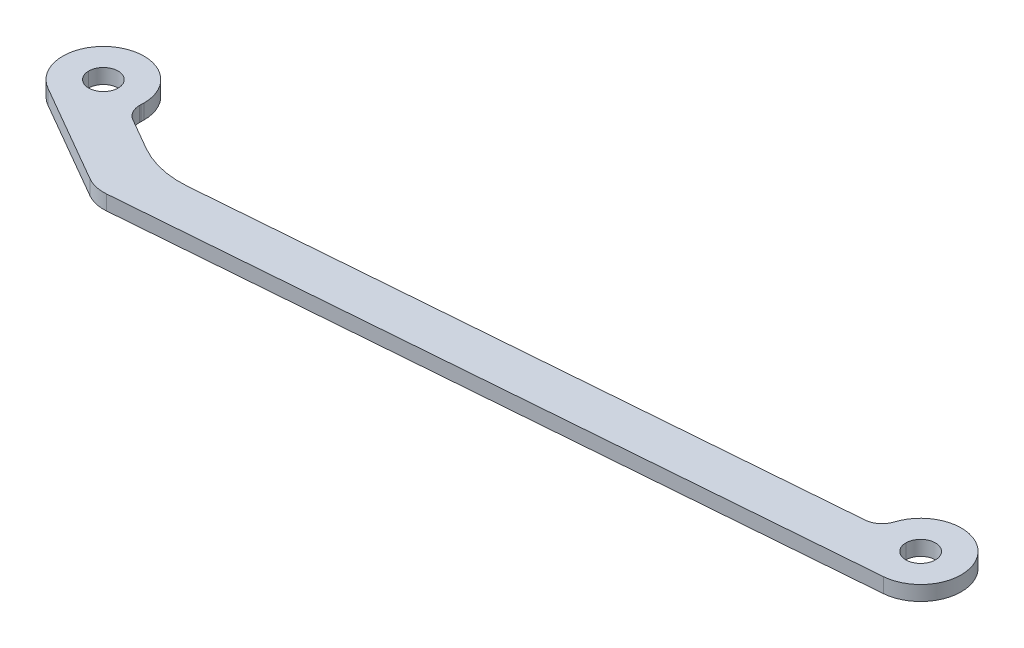
ISO-10303-21;
HEADER;
FILE_DESCRIPTION(('STEP AP214'),'2;1');
FILE_NAME('part.step','',(''),(''),'','','');
FILE_SCHEMA(('AUTOMOTIVE_DESIGN { 1 0 10303 214 1 1 1 1 }'));
ENDSEC;
DATA;
#1=APPLICATION_CONTEXT('core data for automotive mechanical design processes');
#2=APPLICATION_PROTOCOL_DEFINITION('international standard','automotive_design',2000,#1);
#3=PRODUCT_CONTEXT('',#1,'mechanical');
#4=PRODUCT('Part','Part','',(#3));
#5=PRODUCT_RELATED_PRODUCT_CATEGORY('part','',(#4));
#6=PRODUCT_DEFINITION_FORMATION('','',#4);
#7=PRODUCT_DEFINITION_CONTEXT('part definition',#1,'design');
#8=PRODUCT_DEFINITION('design','',#6,#7);
#9=PRODUCT_DEFINITION_SHAPE('','',#8);
#10=(LENGTH_UNIT() NAMED_UNIT(*) SI_UNIT(.MILLI.,.METRE.));
#11=(NAMED_UNIT(*) PLANE_ANGLE_UNIT() SI_UNIT($,.RADIAN.));
#12=(NAMED_UNIT(*) SI_UNIT($,.STERADIAN.) SOLID_ANGLE_UNIT());
#13=UNCERTAINTY_MEASURE_WITH_UNIT(LENGTH_MEASURE(1.E-05),#10,'distance_accuracy_value','');
#14=(GEOMETRIC_REPRESENTATION_CONTEXT(3) GLOBAL_UNCERTAINTY_ASSIGNED_CONTEXT((#13)) GLOBAL_UNIT_ASSIGNED_CONTEXT((#10,
#11,#12)) REPRESENTATION_CONTEXT('',''));
#15=CARTESIAN_POINT('',(0.,0.,0.));
#16=DIRECTION('',(0.,0.,1.));
#17=DIRECTION('',(1.,0.,0.));
#18=AXIS2_PLACEMENT_3D('',#15,#16,#17);
#19=CARTESIAN_POINT('',(0.,-9.72116766041997,-5.72116766042007));
#20=DIRECTION('',(0.,1.,0.));
#21=DIRECTION('',(0.,0.,-1.));
#22=AXIS2_PLACEMENT_3D('',#19,#20,#21);
#23=PLANE('',#22);
#24=CARTESIAN_POINT('',(221.4,-9.72116766041997,-5.72116766042007));
#25=DIRECTION('',(0.,1.,0.));
#26=DIRECTION('',(1.,0.,0.));
#27=AXIS2_PLACEMENT_3D('',#24,#25,#26);
#28=CIRCLE('',#27,4.);
#29=CARTESIAN_POINT('',(217.4,-9.72116766041997,-5.72116766042005));
#30=VERTEX_POINT('',#29);
#31=CARTESIAN_POINT('',(225.4,-9.72116766041997,-5.72116766042005));
#32=VERTEX_POINT('',#31);
#33=EDGE_CURVE('E346',#30,#32,#28,.T.);
#34=ORIENTED_EDGE('',*,*,#33,.T.);
#35=CARTESIAN_POINT('',(221.4,-9.72116766041997,-5.72116766042007));
#36=DIRECTION('',(0.,1.,0.));
#37=DIRECTION('',(1.,0.,0.));
#38=AXIS2_PLACEMENT_3D('',#35,#36,#37);
#39=CIRCLE('',#38,4.);
#40=EDGE_CURVE('E11',#32,#30,#39,.T.);
#41=ORIENTED_EDGE('',*,*,#40,.T.);
#42=EDGE_LOOP('',(#34,#41));
#43=FACE_BOUND('',#42,.T.);
#44=CARTESIAN_POINT('',(0.,-9.72116766041997,-5.72116766042007));
#45=DIRECTION('',(0.,1.,0.));
#46=DIRECTION('',(1.,0.,0.));
#47=AXIS2_PLACEMENT_3D('',#44,#45,#46);
#48=CIRCLE('',#47,4.);
#49=CARTESIAN_POINT('',(-4.,-9.72116766041997,-5.72116766042005));
#50=VERTEX_POINT('',#49);
#51=CARTESIAN_POINT('',(4.,-9.72116766041997,-5.72116766042005));
#52=VERTEX_POINT('',#51);
#53=EDGE_CURVE('E300',#50,#52,#48,.T.);
#54=ORIENTED_EDGE('',*,*,#53,.T.);
#55=CARTESIAN_POINT('',(0.,-9.72116766041997,-5.72116766042007));
#56=DIRECTION('',(0.,1.,0.));
#57=DIRECTION('',(1.,0.,0.));
#58=AXIS2_PLACEMENT_3D('',#55,#56,#57);
#59=CIRCLE('',#58,4.);
#60=EDGE_CURVE('E139',#52,#50,#59,.T.);
#61=ORIENTED_EDGE('',*,*,#60,.T.);
#62=EDGE_LOOP('',(#54,#61));
#63=FACE_BOUND('',#62,.T.);
#64=CARTESIAN_POINT('',(0.,-9.72116766041997,-5.72116766042007));
#65=DIRECTION('',(0.,1.,0.));
#66=DIRECTION('',(1.,0.,0.));
#67=AXIS2_PLACEMENT_3D('',#64,#65,#66);
#68=CIRCLE('',#67,11.);
#69=CARTESIAN_POINT('',(10.9724558586343,-9.72116766041998,-4.94321365771633));
#70=VERTEX_POINT('',#69);
#71=CARTESIAN_POINT('',(11.,-9.72116766041997,-5.72116766042005));
#72=VERTEX_POINT('',#71);
#73=EDGE_CURVE('E270',#70,#72,#68,.T.);
#74=ORIENTED_EDGE('',*,*,#73,.F.);
#75=CARTESIAN_POINT('',(15.9599357943771,-9.72116766041999,-4.58959820194191));
#76=DIRECTION('',(0.,-1.,0.));
#77=DIRECTION('',(1.,0.,0.));
#78=AXIS2_PLACEMENT_3D('',#75,#76,#77);
#79=CIRCLE('',#78,5.);
#80=CARTESIAN_POINT('',(10.9599357943771,-9.72116766041999,-4.58959820194189));
#81=VERTEX_POINT('',#80);
#82=EDGE_CURVE('E313',#81,#70,#79,.T.);
#83=ORIENTED_EDGE('',*,*,#82,.F.);
#84=CARTESIAN_POINT('',(15.9599357943771,-9.72116766041999,-4.58959820194191));
#85=DIRECTION('',(0.,-1.,0.));
#86=DIRECTION('',(1.,0.,0.));
#87=AXIS2_PLACEMENT_3D('',#84,#85,#86);
#88=CIRCLE('',#87,5.);
#89=CARTESIAN_POINT('',(13.4599357943771,-9.72116766042003,-0.259471183019712));
#90=VERTEX_POINT('',#89);
#91=EDGE_CURVE('E258',#90,#81,#88,.T.);
#92=ORIENTED_EDGE('',*,*,#91,.F.);
#93=DIRECTION('',(-0.866025403784508,0.,-0.499999999999881));
#94=VECTOR('',#93,1.);
#95=CARTESIAN_POINT('',(21.9707185919304,-9.72116766042008,4.65423155616053));
#96=LINE('',#95,#94);
#97=CARTESIAN_POINT('',(21.9707185919304,-9.72116766042008,4.65423155616055));
#98=VERTEX_POINT('',#97);
#99=EDGE_CURVE('E242',#98,#90,#96,.T.);
#100=ORIENTED_EDGE('',*,*,#99,.F.);
#101=CARTESIAN_POINT('',(34.4707185919301,-9.72116766041985,-16.9964035384499));
#102=DIRECTION('',(0.,-1.,0.));
#103=DIRECTION('',(1.,0.,0.));
#104=AXIS2_PLACEMENT_3D('',#101,#102,#103);
#105=CIRCLE('',#104,24.9999999999994);
#106=CARTESIAN_POINT('',(36.4447228614748,-9.72116766042012,7.92554075054603));
#107=VERTEX_POINT('',#106);
#108=EDGE_CURVE('E191',#107,#98,#105,.T.);
#109=ORIENTED_EDGE('',*,*,#108,.F.);
#110=DIRECTION('',(-0.996877771559839,0.,0.0789601707817876));
#111=VECTOR('',#110,1.);
#112=CARTESIAN_POINT('',(206.534952986696,-9.72116766041997,-5.54687683379449));
#113=LINE('',#112,#111);
#114=CARTESIAN_POINT('',(206.534952986696,-9.72116766041997,-5.54687683379449));
#115=VERTEX_POINT('',#114);
#116=EDGE_CURVE('E202',#115,#107,#113,.T.);
#117=ORIENTED_EDGE('',*,*,#116,.F.);
#118=CARTESIAN_POINT('',(206.140152132787,-9.72116766041992,-10.5312656915937));
#119=DIRECTION('',(0.,-1.,0.));
#120=DIRECTION('',(1.,0.,0.));
#121=AXIS2_PLACEMENT_3D('',#118,#119,#120);
#122=CIRCLE('',#121,5.);
#123=CARTESIAN_POINT('',(210.908854591291,-9.72116766041994,-9.02811005685194));
#124=VERTEX_POINT('',#123);
#125=EDGE_CURVE('E206',#124,#115,#122,.T.);
#126=ORIENTED_EDGE('',*,*,#125,.F.);
#127=CARTESIAN_POINT('',(221.4,-9.72116766041997,-5.72116766042007));
#128=DIRECTION('',(0.,1.,0.));
#129=DIRECTION('',(1.,0.,0.));
#130=AXIS2_PLACEMENT_3D('',#127,#128,#129);
#131=CIRCLE('',#130,11.);
#132=CARTESIAN_POINT('',(222.2685618786,-9.72116766042009,5.24448782673815));
#133=VERTEX_POINT('',#132);
#134=EDGE_CURVE('E233',#133,#124,#131,.T.);
#135=ORIENTED_EDGE('',*,*,#134,.F.);
#136=DIRECTION('',(0.996877771559839,0.,-0.0789601707817876));
#137=VECTOR('',#136,1.);
#138=CARTESIAN_POINT('',(27.2685618785997,-9.72116766042025,20.6899453760184));
#139=LINE('',#138,#137);
#140=CARTESIAN_POINT('',(27.2685618785997,-9.72116766042025,20.6899453760184));
#141=VERTEX_POINT('',#140);
#142=EDGE_CURVE('E250',#141,#133,#139,.T.);
#143=ORIENTED_EDGE('',*,*,#142,.F.);
#144=CARTESIAN_POINT('',(26.4789601707818,-9.72116766042014,10.72116766042));
#145=DIRECTION('',(0.,1.,0.));
#146=DIRECTION('',(1.,0.,0.));
#147=AXIS2_PLACEMENT_3D('',#144,#145,#146);
#148=CIRCLE('',#147,10.);
#149=CARTESIAN_POINT('',(21.4789601707818,-9.72116766042024,19.3814216982645));
#150=VERTEX_POINT('',#149);
#151=EDGE_CURVE('E294',#150,#141,#148,.T.);
#152=ORIENTED_EDGE('',*,*,#151,.F.);
#153=DIRECTION('',(0.866025403784454,0.,0.499999999999974));
#154=VECTOR('',#153,1.);
#155=CARTESIAN_POINT('',(-5.49999999999986,-9.72116766042007,3.80511178120851));
#156=LINE('',#155,#154);
#157=CARTESIAN_POINT('',(-5.49999999997703,-9.72116766042007,3.80511178122201));
#158=VERTEX_POINT('',#157);
#159=EDGE_CURVE('E351',#158,#150,#156,.T.);
#160=ORIENTED_EDGE('',*,*,#159,.F.);
#161=CARTESIAN_POINT('',(0.,-9.72116766041997,-5.72116766042007));
#162=DIRECTION('',(0.,1.,0.));
#163=DIRECTION('',(1.,0.,0.));
#164=AXIS2_PLACEMENT_3D('',#161,#162,#163);
#165=CIRCLE('',#164,11.);
#166=CARTESIAN_POINT('',(-11.,-9.72116766041997,-5.72116766042005));
#167=VERTEX_POINT('',#166);
#168=EDGE_CURVE('E308',#167,#158,#165,.T.);
#169=ORIENTED_EDGE('',*,*,#168,.F.);
#170=CARTESIAN_POINT('',(0.,-9.72116766041997,-5.72116766042007));
#171=DIRECTION('',(0.,1.,0.));
#172=DIRECTION('',(1.,0.,0.));
#173=AXIS2_PLACEMENT_3D('',#170,#171,#172);
#174=CIRCLE('',#173,11.);
#175=EDGE_CURVE('E223',#72,#167,#174,.T.);
#176=ORIENTED_EDGE('',*,*,#175,.F.);
#177=EDGE_LOOP('',(#74,#83,#92,#100,#109,#117,#126,#135,#143,#152,#160,#169,#176));
#178=FACE_BOUND('',#177,.T.);
#179=ADVANCED_FACE('F16',(#43,#63,#178),#23,.F.);
#180=CARTESIAN_POINT('',(0.,-5.72116766041997,-5.72116766042003));
#181=DIRECTION('',(0.,1.,0.));
#182=DIRECTION('',(0.,0.,-1.));
#183=AXIS2_PLACEMENT_3D('',#180,#181,#182);
#184=PLANE('',#183);
#185=CARTESIAN_POINT('',(221.4,-5.72116766041997,-5.72116766042003));
#186=DIRECTION('',(0.,1.,0.));
#187=DIRECTION('',(1.,0.,0.));
#188=AXIS2_PLACEMENT_3D('',#185,#186,#187);
#189=CIRCLE('',#188,4.);
#190=CARTESIAN_POINT('',(217.4,-5.72116766041997,-5.72116766042005));
#191=VERTEX_POINT('',#190);
#192=CARTESIAN_POINT('',(225.4,-5.72116766041997,-5.72116766042005));
#193=VERTEX_POINT('',#192);
#194=EDGE_CURVE('E263',#191,#193,#189,.T.);
#195=ORIENTED_EDGE('',*,*,#194,.F.);
#196=CARTESIAN_POINT('',(221.4,-5.72116766041997,-5.72116766042003));
#197=DIRECTION('',(0.,1.,0.));
#198=DIRECTION('',(1.,0.,0.));
#199=AXIS2_PLACEMENT_3D('',#196,#197,#198);
#200=CIRCLE('',#199,4.);
#201=EDGE_CURVE('E27',#193,#191,#200,.T.);
#202=ORIENTED_EDGE('',*,*,#201,.F.);
#203=EDGE_LOOP('',(#195,#202));
#204=FACE_BOUND('',#203,.T.);
#205=CARTESIAN_POINT('',(0.,-5.72116766041997,-5.72116766042003));
#206=DIRECTION('',(0.,1.,0.));
#207=DIRECTION('',(1.,0.,0.));
#208=AXIS2_PLACEMENT_3D('',#205,#206,#207);
#209=CIRCLE('',#208,4.);
#210=CARTESIAN_POINT('',(-4.,-5.72116766041997,-5.72116766042005));
#211=VERTEX_POINT('',#210);
#212=CARTESIAN_POINT('',(4.,-5.72116766041997,-5.72116766042005));
#213=VERTEX_POINT('',#212);
#214=EDGE_CURVE('E312',#211,#213,#209,.T.);
#215=ORIENTED_EDGE('',*,*,#214,.F.);
#216=CARTESIAN_POINT('',(0.,-5.72116766041997,-5.72116766042003));
#217=DIRECTION('',(0.,1.,0.));
#218=DIRECTION('',(1.,0.,0.));
#219=AXIS2_PLACEMENT_3D('',#216,#217,#218);
#220=CIRCLE('',#219,4.);
#221=EDGE_CURVE('E235',#213,#211,#220,.T.);
#222=ORIENTED_EDGE('',*,*,#221,.F.);
#223=EDGE_LOOP('',(#215,#222));
#224=FACE_BOUND('',#223,.T.);
#225=CARTESIAN_POINT('',(0.,-5.72116766041997,-5.72116766042003));
#226=DIRECTION('',(0.,1.,0.));
#227=DIRECTION('',(1.,0.,0.));
#228=AXIS2_PLACEMENT_3D('',#225,#226,#227);
#229=CIRCLE('',#228,11.);
#230=CARTESIAN_POINT('',(10.9724558586343,-5.72116766041998,-4.94321365771629));
#231=VERTEX_POINT('',#230);
#232=CARTESIAN_POINT('',(11.,-5.72116766041997,-5.72116766042005));
#233=VERTEX_POINT('',#232);
#234=EDGE_CURVE('E268',#231,#233,#229,.T.);
#235=ORIENTED_EDGE('',*,*,#234,.T.);
#236=CARTESIAN_POINT('',(0.,-5.72116766041997,-5.72116766042003));
#237=DIRECTION('',(0.,1.,0.));
#238=DIRECTION('',(1.,0.,0.));
#239=AXIS2_PLACEMENT_3D('',#236,#237,#238);
#240=CIRCLE('',#239,11.);
#241=CARTESIAN_POINT('',(-11.,-5.72116766041997,-5.72116766042005));
#242=VERTEX_POINT('',#241);
#243=EDGE_CURVE('E347',#233,#242,#240,.T.);
#244=ORIENTED_EDGE('',*,*,#243,.T.);
#245=CARTESIAN_POINT('',(0.,-5.72116766041997,-5.72116766042003));
#246=DIRECTION('',(0.,1.,0.));
#247=DIRECTION('',(1.,0.,0.));
#248=AXIS2_PLACEMENT_3D('',#245,#246,#247);
#249=CIRCLE('',#248,11.);
#250=CARTESIAN_POINT('',(-5.49999999997703,-5.72116766042007,3.80511178122205));
#251=VERTEX_POINT('',#250);
#252=EDGE_CURVE('E222',#242,#251,#249,.T.);
#253=ORIENTED_EDGE('',*,*,#252,.T.);
#254=DIRECTION('',(0.866025403784454,0.,0.499999999999974));
#255=VECTOR('',#254,1.);
#256=CARTESIAN_POINT('',(-5.49999999999986,-5.72116766042007,3.80511178120855));
#257=LINE('',#256,#255);
#258=CARTESIAN_POINT('',(21.4789601707818,-5.72116766042023,19.3814216982645));
#259=VERTEX_POINT('',#258);
#260=EDGE_CURVE('E299',#251,#259,#257,.T.);
#261=ORIENTED_EDGE('',*,*,#260,.T.);
#262=CARTESIAN_POINT('',(26.4789601707818,-5.72116766042014,10.7211676604201));
#263=DIRECTION('',(0.,1.,0.));
#264=DIRECTION('',(1.,0.,0.));
#265=AXIS2_PLACEMENT_3D('',#262,#263,#264);
#266=CIRCLE('',#265,10.);
#267=CARTESIAN_POINT('',(27.2685618785997,-5.72116766042025,20.6899453760184));
#268=VERTEX_POINT('',#267);
#269=EDGE_CURVE('E262',#259,#268,#266,.T.);
#270=ORIENTED_EDGE('',*,*,#269,.T.);
#271=DIRECTION('',(0.996877771559839,0.,-0.0789601707817876));
#272=VECTOR('',#271,1.);
#273=CARTESIAN_POINT('',(27.2685618785997,-5.72116766042025,20.6899453760184));
#274=LINE('',#273,#272);
#275=CARTESIAN_POINT('',(222.2685618786,-5.72116766042009,5.24448782673819));
#276=VERTEX_POINT('',#275);
#277=EDGE_CURVE('E230',#268,#276,#274,.T.);
#278=ORIENTED_EDGE('',*,*,#277,.T.);
#279=CARTESIAN_POINT('',(221.4,-5.72116766041997,-5.72116766042003));
#280=DIRECTION('',(0.,1.,0.));
#281=DIRECTION('',(1.,0.,0.));
#282=AXIS2_PLACEMENT_3D('',#279,#280,#281);
#283=CIRCLE('',#282,11.);
#284=CARTESIAN_POINT('',(210.908854591291,-5.72116766041994,-9.0281100568519));
#285=VERTEX_POINT('',#284);
#286=EDGE_CURVE('E197',#276,#285,#283,.T.);
#287=ORIENTED_EDGE('',*,*,#286,.T.);
#288=CARTESIAN_POINT('',(206.140152132787,-5.72116766041992,-10.5312656915936));
#289=DIRECTION('',(0.,-1.,0.));
#290=DIRECTION('',(1.,0.,0.));
#291=AXIS2_PLACEMENT_3D('',#288,#289,#290);
#292=CIRCLE('',#291,5.);
#293=CARTESIAN_POINT('',(206.534952986696,-5.72116766041997,-5.54687683379445));
#294=VERTEX_POINT('',#293);
#295=EDGE_CURVE('E194',#285,#294,#292,.T.);
#296=ORIENTED_EDGE('',*,*,#295,.T.);
#297=DIRECTION('',(-0.996877771559839,0.,0.0789601707817876));
#298=VECTOR('',#297,1.);
#299=CARTESIAN_POINT('',(206.534952986696,-5.72116766041997,-5.54687683379445));
#300=LINE('',#299,#298);
#301=CARTESIAN_POINT('',(36.4447228614748,-5.72116766042011,7.92554075054607));
#302=VERTEX_POINT('',#301);
#303=EDGE_CURVE('E179',#294,#302,#300,.T.);
#304=ORIENTED_EDGE('',*,*,#303,.T.);
#305=CARTESIAN_POINT('',(34.4707185919301,-5.72116766041985,-16.9964035384499));
#306=DIRECTION('',(0.,-1.,0.));
#307=DIRECTION('',(1.,0.,0.));
#308=AXIS2_PLACEMENT_3D('',#305,#306,#307);
#309=CIRCLE('',#308,24.9999999999994);
#310=CARTESIAN_POINT('',(21.9707185919304,-5.72116766042008,4.65423155616059));
#311=VERTEX_POINT('',#310);
#312=EDGE_CURVE('E288',#302,#311,#309,.T.);
#313=ORIENTED_EDGE('',*,*,#312,.T.);
#314=DIRECTION('',(-0.866025403784508,0.,-0.499999999999881));
#315=VECTOR('',#314,1.);
#316=CARTESIAN_POINT('',(21.9707185919304,-5.72116766042008,4.65423155616057));
#317=LINE('',#316,#315);
#318=CARTESIAN_POINT('',(13.4599357943771,-5.72116766042003,-0.259471183019671));
#319=VERTEX_POINT('',#318);
#320=EDGE_CURVE('E238',#311,#319,#317,.T.);
#321=ORIENTED_EDGE('',*,*,#320,.T.);
#322=CARTESIAN_POINT('',(15.9599357943771,-5.72116766041998,-4.58959820194187));
#323=DIRECTION('',(0.,-1.,0.));
#324=DIRECTION('',(1.,0.,0.));
#325=AXIS2_PLACEMENT_3D('',#322,#323,#324);
#326=CIRCLE('',#325,5.);
#327=CARTESIAN_POINT('',(10.9599357943771,-5.72116766041998,-4.58959820194189));
#328=VERTEX_POINT('',#327);
#329=EDGE_CURVE('E42',#319,#328,#326,.T.);
#330=ORIENTED_EDGE('',*,*,#329,.T.);
#331=CARTESIAN_POINT('',(15.9599357943771,-5.72116766041998,-4.58959820194187));
#332=DIRECTION('',(0.,-1.,0.));
#333=DIRECTION('',(1.,0.,0.));
#334=AXIS2_PLACEMENT_3D('',#331,#332,#333);
#335=CIRCLE('',#334,5.);
#336=EDGE_CURVE('E224',#328,#231,#335,.T.);
#337=ORIENTED_EDGE('',*,*,#336,.T.);
#338=EDGE_LOOP('',(#235,#244,#253,#261,#270,#278,#287,#296,#304,#313,#321,#330,#337));
#339=FACE_BOUND('',#338,.T.);
#340=ADVANCED_FACE('F195',(#204,#224,#339),#184,.T.);
#341=CARTESIAN_POINT('',(221.4,-5.72116766041997,-5.72116766042003));
#342=DIRECTION('',(0.,-1.,0.));
#343=DIRECTION('',(-1.,0.,0.));
#344=AXIS2_PLACEMENT_3D('',#341,#342,#343);
#345=CYLINDRICAL_SURFACE('',#344,4.);
#346=DIRECTION('',(0.,-1.,0.));
#347=VECTOR('',#346,1.);
#348=CARTESIAN_POINT('',(225.4,-5.72116766041997,-5.72116766042003));
#349=LINE('',#348,#347);
#350=EDGE_CURVE('E267',#193,#32,#349,.T.);
#351=ORIENTED_EDGE('',*,*,#350,.F.);
#352=ORIENTED_EDGE('',*,*,#201,.T.);
#353=DIRECTION('',(0.,-1.,0.));
#354=VECTOR('',#353,1.);
#355=CARTESIAN_POINT('',(217.4,-5.72116766041997,-5.72116766042003));
#356=LINE('',#355,#354);
#357=EDGE_CURVE('E229',#191,#30,#356,.T.);
#358=ORIENTED_EDGE('',*,*,#357,.T.);
#359=ORIENTED_EDGE('',*,*,#40,.F.);
#360=EDGE_LOOP('',(#351,#352,#358,#359));
#361=FACE_BOUND('',#360,.T.);
#362=ADVANCED_FACE('F551',(#361),#345,.F.);
#363=CARTESIAN_POINT('',(15.9599357943771,-5.72116766041998,-4.58959820194187));
#364=DIRECTION('',(0.,-1.,0.));
#365=DIRECTION('',(-1.,0.,0.));
#366=AXIS2_PLACEMENT_3D('',#363,#364,#365);
#367=CYLINDRICAL_SURFACE('',#366,5.);
#368=DIRECTION('',(0.,-1.,0.));
#369=VECTOR('',#368,1.);
#370=CARTESIAN_POINT('',(10.9599357943771,-5.72116766041998,-4.58959820194187));
#371=LINE('',#370,#369);
#372=EDGE_CURVE('E228',#328,#81,#371,.T.);
#373=ORIENTED_EDGE('',*,*,#372,.F.);
#374=ORIENTED_EDGE('',*,*,#329,.F.);
#375=DIRECTION('',(0.,-1.,0.));
#376=VECTOR('',#375,1.);
#377=CARTESIAN_POINT('',(13.4599357943771,-5.72116766042003,-0.259471183019671));
#378=LINE('',#377,#376);
#379=EDGE_CURVE('E239',#319,#90,#378,.T.);
#380=ORIENTED_EDGE('',*,*,#379,.T.);
#381=ORIENTED_EDGE('',*,*,#91,.T.);
#382=EDGE_LOOP('',(#373,#374,#380,#381));
#383=FACE_BOUND('',#382,.T.);
#384=ADVANCED_FACE('F555',(#383),#367,.F.);
#385=CARTESIAN_POINT('',(0.,-5.72116766041997,-5.72116766042003));
#386=DIRECTION('',(0.,-1.,0.));
#387=DIRECTION('',(-1.,0.,0.));
#388=AXIS2_PLACEMENT_3D('',#385,#386,#387);
#389=CYLINDRICAL_SURFACE('',#388,4.);
#390=DIRECTION('',(0.,-1.,0.));
#391=VECTOR('',#390,1.);
#392=CARTESIAN_POINT('',(4.,-5.72116766041997,-5.72116766042003));
#393=LINE('',#392,#391);
#394=EDGE_CURVE('E20',#213,#52,#393,.T.);
#395=ORIENTED_EDGE('',*,*,#394,.F.);
#396=ORIENTED_EDGE('',*,*,#221,.T.);
#397=DIRECTION('',(0.,-1.,0.));
#398=VECTOR('',#397,1.);
#399=CARTESIAN_POINT('',(-4.,-5.72116766041997,-5.72116766042003));
#400=LINE('',#399,#398);
#401=EDGE_CURVE('E303',#211,#50,#400,.T.);
#402=ORIENTED_EDGE('',*,*,#401,.T.);
#403=ORIENTED_EDGE('',*,*,#60,.F.);
#404=EDGE_LOOP('',(#395,#396,#402,#403));
#405=FACE_BOUND('',#404,.T.);
#406=ADVANCED_FACE('F566',(#405),#389,.F.);
#407=CARTESIAN_POINT('',(21.9707185919304,-5.72116766042008,4.65423155616057));
#408=DIRECTION('',(-0.499999999999881,0.,0.866025403784508));
#409=DIRECTION('',(0.,1.,0.));
#410=AXIS2_PLACEMENT_3D('',#407,#408,#409);
#411=PLANE('',#410);
#412=ORIENTED_EDGE('',*,*,#99,.T.);
#413=ORIENTED_EDGE('',*,*,#379,.F.);
#414=ORIENTED_EDGE('',*,*,#320,.F.);
#415=DIRECTION('',(0.,-1.,0.));
#416=VECTOR('',#415,1.);
#417=CARTESIAN_POINT('',(21.9707185919304,-5.72116766042008,4.65423155616059));
#418=LINE('',#417,#416);
#419=EDGE_CURVE('E246',#311,#98,#418,.T.);
#420=ORIENTED_EDGE('',*,*,#419,.T.);
#421=EDGE_LOOP('',(#412,#413,#414,#420));
#422=FACE_BOUND('',#421,.T.);
#423=ADVANCED_FACE('F582',(#422),#411,.F.);
#424=CARTESIAN_POINT('',(34.4707185919301,-5.72116766041985,-16.9964035384499));
#425=DIRECTION('',(0.,-1.,0.));
#426=DIRECTION('',(-1.,0.,0.));
#427=AXIS2_PLACEMENT_3D('',#424,#425,#426);
#428=CYLINDRICAL_SURFACE('',#427,24.9999999999994);
#429=ORIENTED_EDGE('',*,*,#108,.T.);
#430=ORIENTED_EDGE('',*,*,#419,.F.);
#431=ORIENTED_EDGE('',*,*,#312,.F.);
#432=DIRECTION('',(0.,-1.,0.));
#433=VECTOR('',#432,1.);
#434=CARTESIAN_POINT('',(36.4447228614748,-5.72116766042011,7.92554075054607));
#435=LINE('',#434,#433);
#436=EDGE_CURVE('E187',#302,#107,#435,.T.);
#437=ORIENTED_EDGE('',*,*,#436,.T.);
#438=EDGE_LOOP('',(#429,#430,#431,#437));
#439=FACE_BOUND('',#438,.T.);
#440=ADVANCED_FACE('F18',(#439),#428,.F.);
#441=CARTESIAN_POINT('',(206.534952986696,-5.72116766041997,-5.54687683379445));
#442=DIRECTION('',(0.0789601707817876,0.,0.996877771559839));
#443=DIRECTION('',(-1.32240600623606E-13,-1.,0.));
#444=AXIS2_PLACEMENT_3D('',#441,#442,#443);
#445=PLANE('',#444);
#446=ORIENTED_EDGE('',*,*,#116,.T.);
#447=ORIENTED_EDGE('',*,*,#436,.F.);
#448=ORIENTED_EDGE('',*,*,#303,.F.);
#449=DIRECTION('',(0.,-1.,0.));
#450=VECTOR('',#449,1.);
#451=CARTESIAN_POINT('',(206.534952986696,-5.72116766041997,-5.54687683379445));
#452=LINE('',#451,#450);
#453=EDGE_CURVE('E184',#294,#115,#452,.T.);
#454=ORIENTED_EDGE('',*,*,#453,.T.);
#455=EDGE_LOOP('',(#446,#447,#448,#454));
#456=FACE_BOUND('',#455,.T.);
#457=ADVANCED_FACE('F182',(#456),#445,.F.);
#458=CARTESIAN_POINT('',(206.140152132787,-5.72116766041992,-10.5312656915936));
#459=DIRECTION('',(0.,-1.,0.));
#460=DIRECTION('',(-1.,0.,0.));
#461=AXIS2_PLACEMENT_3D('',#458,#459,#460);
#462=CYLINDRICAL_SURFACE('',#461,5.);
#463=ORIENTED_EDGE('',*,*,#125,.T.);
#464=ORIENTED_EDGE('',*,*,#453,.F.);
#465=ORIENTED_EDGE('',*,*,#295,.F.);
#466=DIRECTION('',(0.,-1.,0.));
#467=VECTOR('',#466,1.);
#468=CARTESIAN_POINT('',(210.908854591291,-5.72116766041994,-9.0281100568519));
#469=LINE('',#468,#467);
#470=EDGE_CURVE('E255',#285,#124,#469,.T.);
#471=ORIENTED_EDGE('',*,*,#470,.T.);
#472=EDGE_LOOP('',(#463,#464,#465,#471));
#473=FACE_BOUND('',#472,.T.);
#474=ADVANCED_FACE('F204',(#473),#462,.F.);
#475=CARTESIAN_POINT('',(221.4,-5.72116766041997,-5.72116766042003));
#476=DIRECTION('',(0.,-1.,0.));
#477=DIRECTION('',(-1.,0.,0.));
#478=AXIS2_PLACEMENT_3D('',#475,#476,#477);
#479=CYLINDRICAL_SURFACE('',#478,11.);
#480=ORIENTED_EDGE('',*,*,#134,.T.);
#481=ORIENTED_EDGE('',*,*,#470,.F.);
#482=ORIENTED_EDGE('',*,*,#286,.F.);
#483=DIRECTION('',(0.,-1.,0.));
#484=VECTOR('',#483,1.);
#485=CARTESIAN_POINT('',(222.2685618786,-5.72116766042009,5.24448782673819));
#486=LINE('',#485,#484);
#487=EDGE_CURVE('E234',#276,#133,#486,.T.);
#488=ORIENTED_EDGE('',*,*,#487,.T.);
#489=EDGE_LOOP('',(#480,#481,#482,#488));
#490=FACE_BOUND('',#489,.T.);
#491=ADVANCED_FACE('F396',(#490),#479,.T.);
#492=CARTESIAN_POINT('',(27.2685618785997,-5.72116766042025,20.6899453760184));
#493=DIRECTION('',(-0.0789601707817876,0.,-0.996877771559839));
#494=DIRECTION('',(-0.996877771559839,0.,0.0789601707817876));
#495=AXIS2_PLACEMENT_3D('',#492,#493,#494);
#496=PLANE('',#495);
#497=ORIENTED_EDGE('',*,*,#142,.T.);
#498=ORIENTED_EDGE('',*,*,#487,.F.);
#499=ORIENTED_EDGE('',*,*,#277,.F.);
#500=DIRECTION('',(0.,-1.,0.));
#501=VECTOR('',#500,1.);
#502=CARTESIAN_POINT('',(27.2685618785997,-5.72116766042025,20.6899453760184));
#503=LINE('',#502,#501);
#504=EDGE_CURVE('E298',#268,#141,#503,.T.);
#505=ORIENTED_EDGE('',*,*,#504,.T.);
#506=EDGE_LOOP('',(#497,#498,#499,#505));
#507=FACE_BOUND('',#506,.T.);
#508=ADVANCED_FACE('F389',(#507),#496,.F.);
#509=CARTESIAN_POINT('',(26.4789601707818,-5.72116766042014,10.7211676604201));
#510=DIRECTION('',(0.,-1.,0.));
#511=DIRECTION('',(-1.,0.,0.));
#512=AXIS2_PLACEMENT_3D('',#509,#510,#511);
#513=CYLINDRICAL_SURFACE('',#512,10.);
#514=ORIENTED_EDGE('',*,*,#151,.T.);
#515=ORIENTED_EDGE('',*,*,#504,.F.);
#516=ORIENTED_EDGE('',*,*,#269,.F.);
#517=DIRECTION('',(0.,-1.,0.));
#518=VECTOR('',#517,1.);
#519=CARTESIAN_POINT('',(21.4789601707818,-5.72116766042023,19.3814216982645));
#520=LINE('',#519,#518);
#521=EDGE_CURVE('E215',#259,#150,#520,.T.);
#522=ORIENTED_EDGE('',*,*,#521,.T.);
#523=EDGE_LOOP('',(#514,#515,#516,#522));
#524=FACE_BOUND('',#523,.T.);
#525=ADVANCED_FACE('F393',(#524),#513,.T.);
#526=CARTESIAN_POINT('',(-5.49999999999986,-5.72116766042007,3.80511178120855));
#527=DIRECTION('',(0.499999999999974,0.,-0.866025403784454));
#528=DIRECTION('',(0.,-1.,0.));
#529=AXIS2_PLACEMENT_3D('',#526,#527,#528);
#530=PLANE('',#529);
#531=ORIENTED_EDGE('',*,*,#159,.T.);
#532=ORIENTED_EDGE('',*,*,#521,.F.);
#533=ORIENTED_EDGE('',*,*,#260,.F.);
#534=DIRECTION('',(0.,-1.,0.));
#535=VECTOR('',#534,1.);
#536=CARTESIAN_POINT('',(-5.49999999997703,-5.72116766042007,3.80511178122205));
#537=LINE('',#536,#535);
#538=EDGE_CURVE('E271',#251,#158,#537,.T.);
#539=ORIENTED_EDGE('',*,*,#538,.T.);
#540=EDGE_LOOP('',(#531,#532,#533,#539));
#541=FACE_BOUND('',#540,.T.);
#542=ADVANCED_FACE('F398',(#541),#530,.F.);
#543=CARTESIAN_POINT('',(0.,-5.72116766041997,-5.72116766042003));
#544=DIRECTION('',(0.,-1.,0.));
#545=DIRECTION('',(-1.,0.,0.));
#546=AXIS2_PLACEMENT_3D('',#543,#544,#545);
#547=CYLINDRICAL_SURFACE('',#546,11.);
#548=DIRECTION('',(0.,-1.,0.));
#549=VECTOR('',#548,1.);
#550=CARTESIAN_POINT('',(11.,-5.72116766041997,-5.72116766042003));
#551=LINE('',#550,#549);
#552=EDGE_CURVE('E333',#233,#72,#551,.T.);
#553=ORIENTED_EDGE('',*,*,#552,.F.);
#554=ORIENTED_EDGE('',*,*,#234,.F.);
#555=DIRECTION('',(0.,-1.,0.));
#556=VECTOR('',#555,1.);
#557=CARTESIAN_POINT('',(10.9724558586343,-5.72116766041998,-4.94321365771629));
#558=LINE('',#557,#556);
#559=EDGE_CURVE('E309',#231,#70,#558,.T.);
#560=ORIENTED_EDGE('',*,*,#559,.T.);
#561=ORIENTED_EDGE('',*,*,#73,.T.);
#562=EDGE_LOOP('',(#553,#554,#560,#561));
#563=FACE_BOUND('',#562,.T.);
#564=ADVANCED_FACE('F541',(#563),#547,.T.);
#565=CARTESIAN_POINT('',(0.,-5.72116766041997,-5.72116766042003));
#566=DIRECTION('',(0.,-1.,0.));
#567=DIRECTION('',(-1.,0.,0.));
#568=AXIS2_PLACEMENT_3D('',#565,#566,#567);
#569=CYLINDRICAL_SURFACE('',#568,11.);
#570=ORIENTED_EDGE('',*,*,#252,.F.);
#571=DIRECTION('',(0.,-1.,0.));
#572=VECTOR('',#571,1.);
#573=CARTESIAN_POINT('',(-11.,-5.72116766041997,-5.72116766042003));
#574=LINE('',#573,#572);
#575=EDGE_CURVE('E218',#242,#167,#574,.T.);
#576=ORIENTED_EDGE('',*,*,#575,.T.);
#577=ORIENTED_EDGE('',*,*,#168,.T.);
#578=ORIENTED_EDGE('',*,*,#538,.F.);
#579=EDGE_LOOP('',(#570,#576,#577,#578));
#580=FACE_BOUND('',#579,.T.);
#581=ADVANCED_FACE('F533',(#580),#569,.T.);
#582=CARTESIAN_POINT('',(0.,-5.72116766041997,-5.72116766042003));
#583=DIRECTION('',(0.,-1.,0.));
#584=DIRECTION('',(-1.,0.,0.));
#585=AXIS2_PLACEMENT_3D('',#582,#583,#584);
#586=CYLINDRICAL_SURFACE('',#585,11.);
#587=ORIENTED_EDGE('',*,*,#243,.F.);
#588=ORIENTED_EDGE('',*,*,#552,.T.);
#589=ORIENTED_EDGE('',*,*,#175,.T.);
#590=ORIENTED_EDGE('',*,*,#575,.F.);
#591=EDGE_LOOP('',(#587,#588,#589,#590));
#592=FACE_BOUND('',#591,.T.);
#593=ADVANCED_FACE('F522',(#592),#586,.T.);
#594=CARTESIAN_POINT('',(0.,-5.72116766041997,-5.72116766042003));
#595=DIRECTION('',(0.,-1.,0.));
#596=DIRECTION('',(-1.,0.,0.));
#597=AXIS2_PLACEMENT_3D('',#594,#595,#596);
#598=CYLINDRICAL_SURFACE('',#597,4.);
#599=ORIENTED_EDGE('',*,*,#214,.T.);
#600=ORIENTED_EDGE('',*,*,#394,.T.);
#601=ORIENTED_EDGE('',*,*,#53,.F.);
#602=ORIENTED_EDGE('',*,*,#401,.F.);
#603=EDGE_LOOP('',(#599,#600,#601,#602));
#604=FACE_BOUND('',#603,.T.);
#605=ADVANCED_FACE('F516',(#604),#598,.F.);
#606=CARTESIAN_POINT('',(15.9599357943771,-5.72116766041998,-4.58959820194187));
#607=DIRECTION('',(0.,-1.,0.));
#608=DIRECTION('',(-1.,0.,0.));
#609=AXIS2_PLACEMENT_3D('',#606,#607,#608);
#610=CYLINDRICAL_SURFACE('',#609,5.);
#611=ORIENTED_EDGE('',*,*,#336,.F.);
#612=ORIENTED_EDGE('',*,*,#372,.T.);
#613=ORIENTED_EDGE('',*,*,#82,.T.);
#614=ORIENTED_EDGE('',*,*,#559,.F.);
#615=EDGE_LOOP('',(#611,#612,#613,#614));
#616=FACE_BOUND('',#615,.T.);
#617=ADVANCED_FACE('F521',(#616),#610,.F.);
#618=CARTESIAN_POINT('',(221.4,-5.72116766041997,-5.72116766042003));
#619=DIRECTION('',(0.,-1.,0.));
#620=DIRECTION('',(-1.,0.,0.));
#621=AXIS2_PLACEMENT_3D('',#618,#619,#620);
#622=CYLINDRICAL_SURFACE('',#621,4.);
#623=ORIENTED_EDGE('',*,*,#194,.T.);
#624=ORIENTED_EDGE('',*,*,#350,.T.);
#625=ORIENTED_EDGE('',*,*,#33,.F.);
#626=ORIENTED_EDGE('',*,*,#357,.F.);
#627=EDGE_LOOP('',(#623,#624,#625,#626));
#628=FACE_BOUND('',#627,.T.);
#629=ADVANCED_FACE('F621',(#628),#622,.F.);
#630=CLOSED_SHELL('',(#179,#340,#362,#384,#406,#423,#440,#457,#474,#491,#508,#525,#542,#564,
#581,#593,#605,#617,#629));
#631=MANIFOLD_SOLID_BREP('B1',#630);
#632=ADVANCED_BREP_SHAPE_REPRESENTATION('',(#18,#631),#14);
#633=SHAPE_DEFINITION_REPRESENTATION(#9,#632);
ENDSEC;
END-ISO-10303-21;
